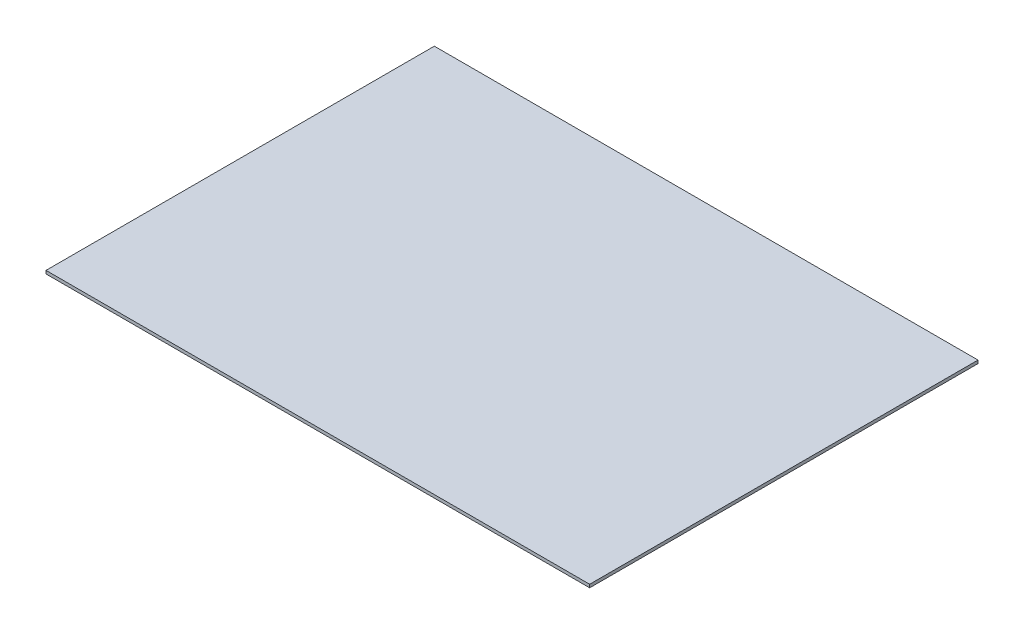
ISO-10303-21;
HEADER;
FILE_DESCRIPTION(('STEP AP214'),'2;1');
FILE_NAME('part.step','',(''),(''),'','','');
FILE_SCHEMA(('AUTOMOTIVE_DESIGN { 1 0 10303 214 1 1 1 1 }'));
ENDSEC;
DATA;
#1=APPLICATION_CONTEXT('core data for automotive mechanical design processes');
#2=APPLICATION_PROTOCOL_DEFINITION('international standard','automotive_design',2000,#1);
#3=PRODUCT_CONTEXT('',#1,'mechanical');
#4=PRODUCT('Part','Part','',(#3));
#5=PRODUCT_RELATED_PRODUCT_CATEGORY('part','',(#4));
#6=PRODUCT_DEFINITION_FORMATION('','',#4);
#7=PRODUCT_DEFINITION_CONTEXT('part definition',#1,'design');
#8=PRODUCT_DEFINITION('design','',#6,#7);
#9=PRODUCT_DEFINITION_SHAPE('','',#8);
#10=(LENGTH_UNIT() NAMED_UNIT(*) SI_UNIT(.MILLI.,.METRE.));
#11=(NAMED_UNIT(*) PLANE_ANGLE_UNIT() SI_UNIT($,.RADIAN.));
#12=(NAMED_UNIT(*) SI_UNIT($,.STERADIAN.) SOLID_ANGLE_UNIT());
#13=UNCERTAINTY_MEASURE_WITH_UNIT(LENGTH_MEASURE(1.E-05),#10,'distance_accuracy_value','');
#14=(GEOMETRIC_REPRESENTATION_CONTEXT(3) GLOBAL_UNCERTAINTY_ASSIGNED_CONTEXT((#13)) GLOBAL_UNIT_ASSIGNED_CONTEXT((#10,
#11,#12)) REPRESENTATION_CONTEXT('',''));
#15=CARTESIAN_POINT('',(0.,0.,0.));
#16=DIRECTION('',(0.,0.,1.));
#17=DIRECTION('',(1.,0.,0.));
#18=AXIS2_PLACEMENT_3D('',#15,#16,#17);
#19=CARTESIAN_POINT('',(0.,2.,0.));
#20=DIRECTION('',(1.,0.,0.));
#21=DIRECTION('',(0.,0.,-1.));
#22=AXIS2_PLACEMENT_3D('',#19,#20,#21);
#23=PLANE('',#22);
#24=DIRECTION('',(0.,0.,1.));
#25=VECTOR('',#24,1.);
#26=CARTESIAN_POINT('',(0.,0.,0.));
#27=LINE('',#26,#25);
#28=CARTESIAN_POINT('',(0.,0.,-250.));
#29=VERTEX_POINT('',#28);
#30=CARTESIAN_POINT('',(0.,0.,0.));
#31=VERTEX_POINT('',#30);
#32=EDGE_CURVE('E107',#29,#31,#27,.T.);
#33=ORIENTED_EDGE('',*,*,#32,.T.);
#34=DIRECTION('',(0.,-1.,0.));
#35=VECTOR('',#34,1.);
#36=CARTESIAN_POINT('',(0.,2.,0.));
#37=LINE('',#36,#35);
#38=CARTESIAN_POINT('',(0.,2.,0.));
#39=VERTEX_POINT('',#38);
#40=EDGE_CURVE('E11',#39,#31,#37,.T.);
#41=ORIENTED_EDGE('',*,*,#40,.F.);
#42=DIRECTION('',(0.,0.,1.));
#43=VECTOR('',#42,1.);
#44=CARTESIAN_POINT('',(0.,2.,0.));
#45=LINE('',#44,#43);
#46=CARTESIAN_POINT('',(0.,2.,-250.));
#47=VERTEX_POINT('',#46);
#48=EDGE_CURVE('E91',#47,#39,#45,.T.);
#49=ORIENTED_EDGE('',*,*,#48,.F.);
#50=DIRECTION('',(0.,-1.,0.));
#51=VECTOR('',#50,1.);
#52=CARTESIAN_POINT('',(0.,2.,-250.));
#53=LINE('',#52,#51);
#54=EDGE_CURVE('E103',#47,#29,#53,.T.);
#55=ORIENTED_EDGE('',*,*,#54,.T.);
#56=EDGE_LOOP('',(#33,#41,#49,#55));
#57=FACE_BOUND('',#56,.T.);
#58=ADVANCED_FACE('F39',(#57),#23,.F.);
#59=CARTESIAN_POINT('',(0.,2.,0.));
#60=DIRECTION('',(0.,0.,-1.));
#61=DIRECTION('',(-1.,0.,0.));
#62=AXIS2_PLACEMENT_3D('',#59,#60,#61);
#63=PLANE('',#62);
#64=DIRECTION('',(1.,0.,0.));
#65=VECTOR('',#64,1.);
#66=CARTESIAN_POINT('',(0.,0.,0.));
#67=LINE('',#66,#65);
#68=CARTESIAN_POINT('',(350.,0.,0.));
#69=VERTEX_POINT('',#68);
#70=EDGE_CURVE('E96',#31,#69,#67,.T.);
#71=ORIENTED_EDGE('',*,*,#70,.T.);
#72=DIRECTION('',(0.,-1.,0.));
#73=VECTOR('',#72,1.);
#74=CARTESIAN_POINT('',(350.,2.,0.));
#75=LINE('',#74,#73);
#76=CARTESIAN_POINT('',(350.,2.,0.));
#77=VERTEX_POINT('',#76);
#78=EDGE_CURVE('E48',#77,#69,#75,.T.);
#79=ORIENTED_EDGE('',*,*,#78,.F.);
#80=DIRECTION('',(1.,0.,0.));
#81=VECTOR('',#80,1.);
#82=CARTESIAN_POINT('',(0.,2.,0.));
#83=LINE('',#82,#81);
#84=EDGE_CURVE('E86',#39,#77,#83,.T.);
#85=ORIENTED_EDGE('',*,*,#84,.F.);
#86=ORIENTED_EDGE('',*,*,#40,.T.);
#87=EDGE_LOOP('',(#71,#79,#85,#86));
#88=FACE_BOUND('',#87,.T.);
#89=ADVANCED_FACE('F95',(#88),#63,.F.);
#90=CARTESIAN_POINT('',(350.,2.,0.));
#91=DIRECTION('',(-1.,0.,0.));
#92=DIRECTION('',(0.,0.,1.));
#93=AXIS2_PLACEMENT_3D('',#90,#91,#92);
#94=PLANE('',#93);
#95=DIRECTION('',(0.,0.,-1.));
#96=VECTOR('',#95,1.);
#97=CARTESIAN_POINT('',(350.,0.,0.));
#98=LINE('',#97,#96);
#99=CARTESIAN_POINT('',(350.,0.,-250.));
#100=VERTEX_POINT('',#99);
#101=EDGE_CURVE('E73',#69,#100,#98,.T.);
#102=ORIENTED_EDGE('',*,*,#101,.T.);
#103=DIRECTION('',(0.,-1.,0.));
#104=VECTOR('',#103,1.);
#105=CARTESIAN_POINT('',(350.,2.,-250.));
#106=LINE('',#105,#104);
#107=CARTESIAN_POINT('',(350.,2.,-250.));
#108=VERTEX_POINT('',#107);
#109=EDGE_CURVE('E98',#108,#100,#106,.T.);
#110=ORIENTED_EDGE('',*,*,#109,.F.);
#111=DIRECTION('',(0.,0.,-1.));
#112=VECTOR('',#111,1.);
#113=CARTESIAN_POINT('',(350.,2.,0.));
#114=LINE('',#113,#112);
#115=EDGE_CURVE('E89',#77,#108,#114,.T.);
#116=ORIENTED_EDGE('',*,*,#115,.F.);
#117=ORIENTED_EDGE('',*,*,#78,.T.);
#118=EDGE_LOOP('',(#102,#110,#116,#117));
#119=FACE_BOUND('',#118,.T.);
#120=ADVANCED_FACE('F99',(#119),#94,.F.);
#121=CARTESIAN_POINT('',(0.,2.,-250.));
#122=DIRECTION('',(0.,0.,1.));
#123=DIRECTION('',(1.,0.,0.));
#124=AXIS2_PLACEMENT_3D('',#121,#122,#123);
#125=PLANE('',#124);
#126=DIRECTION('',(-1.,0.,0.));
#127=VECTOR('',#126,1.);
#128=CARTESIAN_POINT('',(0.,0.,-250.));
#129=LINE('',#128,#127);
#130=EDGE_CURVE('E79',#100,#29,#129,.T.);
#131=ORIENTED_EDGE('',*,*,#130,.T.);
#132=ORIENTED_EDGE('',*,*,#54,.F.);
#133=DIRECTION('',(-1.,0.,0.));
#134=VECTOR('',#133,1.);
#135=CARTESIAN_POINT('',(0.,2.,-250.));
#136=LINE('',#135,#134);
#137=EDGE_CURVE('E56',#108,#47,#136,.T.);
#138=ORIENTED_EDGE('',*,*,#137,.F.);
#139=ORIENTED_EDGE('',*,*,#109,.T.);
#140=EDGE_LOOP('',(#131,#132,#138,#139));
#141=FACE_BOUND('',#140,.T.);
#142=ADVANCED_FACE('F120',(#141),#125,.F.);
#143=CARTESIAN_POINT('',(0.,2.,0.));
#144=DIRECTION('',(0.,-1.,0.));
#145=DIRECTION('',(0.,0.,-1.));
#146=AXIS2_PLACEMENT_3D('',#143,#144,#145);
#147=PLANE('',#146);
#148=ORIENTED_EDGE('',*,*,#48,.T.);
#149=ORIENTED_EDGE('',*,*,#84,.T.);
#150=ORIENTED_EDGE('',*,*,#115,.T.);
#151=ORIENTED_EDGE('',*,*,#137,.T.);
#152=EDGE_LOOP('',(#148,#149,#150,#151));
#153=FACE_BOUND('',#152,.T.);
#154=ADVANCED_FACE('F87',(#153),#147,.F.);
#155=CARTESIAN_POINT('',(0.,0.,0.));
#156=DIRECTION('',(0.,-1.,0.));
#157=DIRECTION('',(0.,0.,-1.));
#158=AXIS2_PLACEMENT_3D('',#155,#156,#157);
#159=PLANE('',#158);
#160=ORIENTED_EDGE('',*,*,#32,.F.);
#161=ORIENTED_EDGE('',*,*,#130,.F.);
#162=ORIENTED_EDGE('',*,*,#101,.F.);
#163=ORIENTED_EDGE('',*,*,#70,.F.);
#164=EDGE_LOOP('',(#160,#161,#162,#163));
#165=FACE_BOUND('',#164,.T.);
#166=ADVANCED_FACE('F123',(#165),#159,.T.);
#167=CLOSED_SHELL('',(#58,#89,#120,#142,#154,#166));
#168=MANIFOLD_SOLID_BREP('B2',#167);
#169=ADVANCED_BREP_SHAPE_REPRESENTATION('',(#18,#168),#14);
#170=SHAPE_DEFINITION_REPRESENTATION(#9,#169);
ENDSEC;
END-ISO-10303-21;
